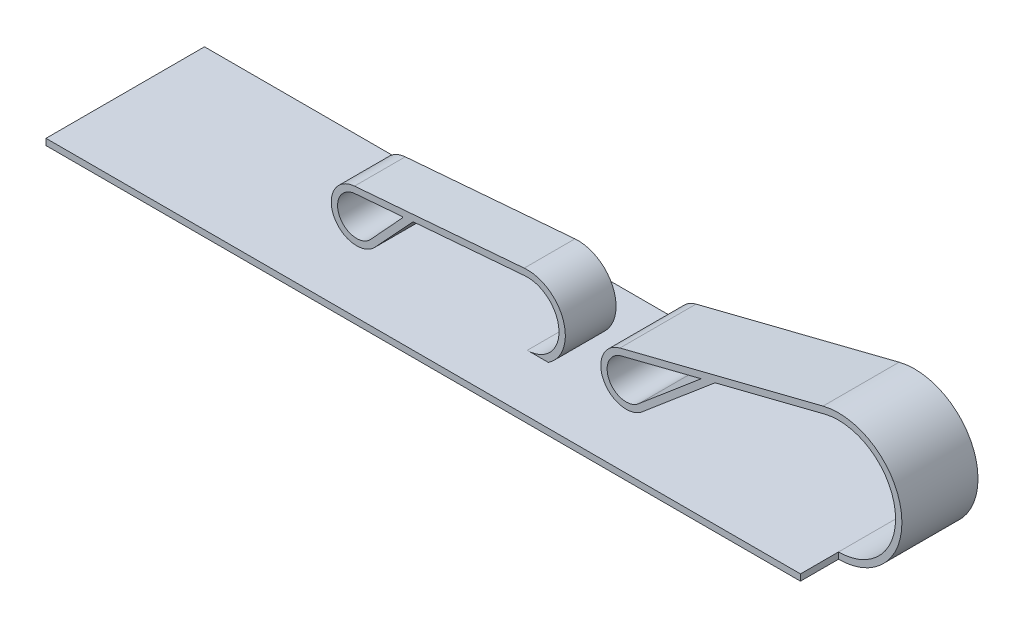
ISO-10303-21;
HEADER;
FILE_DESCRIPTION(('STEP AP214'),'2;1');
FILE_NAME('part.step','',(''),(''),'','','');
FILE_SCHEMA(('AUTOMOTIVE_DESIGN { 1 0 10303 214 1 1 1 1 }'));
ENDSEC;
DATA;
#1=APPLICATION_CONTEXT('core data for automotive mechanical design processes');
#2=APPLICATION_PROTOCOL_DEFINITION('international standard','automotive_design',2000,#1);
#3=PRODUCT_CONTEXT('',#1,'mechanical');
#4=PRODUCT('Part','Part','',(#3));
#5=PRODUCT_RELATED_PRODUCT_CATEGORY('part','',(#4));
#6=PRODUCT_DEFINITION_FORMATION('','',#4);
#7=PRODUCT_DEFINITION_CONTEXT('part definition',#1,'design');
#8=PRODUCT_DEFINITION('design','',#6,#7);
#9=PRODUCT_DEFINITION_SHAPE('','',#8);
#10=(LENGTH_UNIT() NAMED_UNIT(*) SI_UNIT(.MILLI.,.METRE.));
#11=(NAMED_UNIT(*) PLANE_ANGLE_UNIT() SI_UNIT($,.RADIAN.));
#12=(NAMED_UNIT(*) SI_UNIT($,.STERADIAN.) SOLID_ANGLE_UNIT());
#13=UNCERTAINTY_MEASURE_WITH_UNIT(LENGTH_MEASURE(1.E-05),#10,'distance_accuracy_value','');
#14=(GEOMETRIC_REPRESENTATION_CONTEXT(3) GLOBAL_UNCERTAINTY_ASSIGNED_CONTEXT((#13)) GLOBAL_UNIT_ASSIGNED_CONTEXT((#10,
#11,#12)) REPRESENTATION_CONTEXT('',''));
#15=CARTESIAN_POINT('',(0.,0.,0.));
#16=DIRECTION('',(0.,0.,1.));
#17=DIRECTION('',(1.,0.,0.));
#18=AXIS2_PLACEMENT_3D('',#15,#16,#17);
#19=CARTESIAN_POINT('',(127.329435135242,0.,25.));
#20=DIRECTION('',(1.,0.,0.));
#21=DIRECTION('',(0.,0.,-1.));
#22=AXIS2_PLACEMENT_3D('',#19,#20,#21);
#23=PLANE('',#22);
#24=DIRECTION('',(0.,0.,-1.));
#25=VECTOR('',#24,1.);
#26=CARTESIAN_POINT('',(127.329435135242,0.,25.));
#27=LINE('',#26,#25);
#28=CARTESIAN_POINT('',(127.329435135242,0.,7.));
#29=VERTEX_POINT('',#28);
#30=CARTESIAN_POINT('',(127.329435135242,0.,0.));
#31=VERTEX_POINT('',#30);
#32=EDGE_CURVE('E316',#29,#31,#27,.T.);
#33=ORIENTED_EDGE('',*,*,#32,.F.);
#34=DIRECTION('',(0.,-1.,0.));
#35=VECTOR('',#34,1.);
#36=CARTESIAN_POINT('',(127.329435135242,0.,7.));
#37=LINE('',#36,#35);
#38=CARTESIAN_POINT('',(127.329435135242,-1.,7.));
#39=VERTEX_POINT('',#38);
#40=EDGE_CURVE('E365',#29,#39,#37,.T.);
#41=ORIENTED_EDGE('',*,*,#40,.T.);
#42=DIRECTION('',(0.,0.,-1.));
#43=VECTOR('',#42,1.);
#44=CARTESIAN_POINT('',(127.329435135242,-1.,25.));
#45=LINE('',#44,#43);
#46=CARTESIAN_POINT('',(127.329435135242,-1.,0.));
#47=VERTEX_POINT('',#46);
#48=EDGE_CURVE('E312',#39,#47,#45,.T.);
#49=ORIENTED_EDGE('',*,*,#48,.T.);
#50=DIRECTION('',(0.,-1.,0.));
#51=VECTOR('',#50,1.);
#52=CARTESIAN_POINT('',(127.329435135242,0.,0.));
#53=LINE('',#52,#51);
#54=EDGE_CURVE('E296',#31,#47,#53,.T.);
#55=ORIENTED_EDGE('',*,*,#54,.F.);
#56=EDGE_LOOP('',(#33,#41,#49,#55));
#57=FACE_BOUND('',#56,.T.);
#58=ADVANCED_FACE('F39',(#57),#23,.T.);
#59=CARTESIAN_POINT('',(75.2426269984619,5.,16.));
#60=DIRECTION('',(0.,0.,-1.));
#61=DIRECTION('',(-1.,0.,0.));
#62=AXIS2_PLACEMENT_3D('',#59,#60,#61);
#63=CYLINDRICAL_SURFACE('',#62,6.);
#64=CARTESIAN_POINT('',(75.2426269984619,5.,8.));
#65=DIRECTION('',(0.,0.,1.));
#66=DIRECTION('',(1.,0.,0.));
#67=AXIS2_PLACEMENT_3D('',#64,#65,#66);
#68=CIRCLE('',#67,6.);
#69=CARTESIAN_POINT('',(78.5592517888173,0.,8.));
#70=VERTEX_POINT('',#69);
#71=CARTESIAN_POINT('',(74.7562436239485,10.9802534405322,8.));
#72=VERTEX_POINT('',#71);
#73=EDGE_CURVE('E214',#70,#72,#68,.T.);
#74=ORIENTED_EDGE('',*,*,#73,.T.);
#75=DIRECTION('',(0.,0.,-1.));
#76=VECTOR('',#75,1.);
#77=CARTESIAN_POINT('',(74.7562436239485,10.9802534405322,16.));
#78=LINE('',#77,#76);
#79=CARTESIAN_POINT('',(74.7562436239485,10.9802534405322,16.));
#80=VERTEX_POINT('',#79);
#81=EDGE_CURVE('E49',#80,#72,#78,.T.);
#82=ORIENTED_EDGE('',*,*,#81,.F.);
#83=CARTESIAN_POINT('',(75.2426269984619,5.,16.));
#84=DIRECTION('',(0.,0.,1.));
#85=DIRECTION('',(1.,0.,0.));
#86=AXIS2_PLACEMENT_3D('',#83,#84,#85);
#87=CIRCLE('',#86,6.);
#88=CARTESIAN_POINT('',(78.5592517888173,0.,16.));
#89=VERTEX_POINT('',#88);
#90=EDGE_CURVE('E283',#89,#80,#87,.T.);
#91=ORIENTED_EDGE('',*,*,#90,.F.);
#92=DIRECTION('',(0.,0.,-1.));
#93=VECTOR('',#92,1.);
#94=CARTESIAN_POINT('',(78.5592517888173,0.,16.));
#95=LINE('',#94,#93);
#96=EDGE_CURVE('E11',#89,#70,#95,.T.);
#97=ORIENTED_EDGE('',*,*,#96,.T.);
#98=EDGE_LOOP('',(#74,#82,#91,#97));
#99=FACE_BOUND('',#98,.T.);
#100=ADVANCED_FACE('F558',(#99),#63,.T.);
#101=CARTESIAN_POINT('',(-0.395922881299758,4.86801008658501,16.));
#102=DIRECTION('',(0.0810638957522267,-0.996708906755363,0.));
#103=DIRECTION('',(0.996708906755364,0.0810638957522267,0.));
#104=AXIS2_PLACEMENT_3D('',#101,#102,#103);
#105=PLANE('',#104);
#106=DIRECTION('',(-0.996708906755364,-0.0810638957522267,0.));
#107=VECTOR('',#106,1.);
#108=CARTESIAN_POINT('',(-0.395922881299758,4.86801008658501,8.));
#109=LINE('',#108,#107);
#110=CARTESIAN_POINT('',(47.9943397060956,8.8036658986488,8.));
#111=VERTEX_POINT('',#110);
#112=EDGE_CURVE('E217',#72,#111,#109,.T.);
#113=ORIENTED_EDGE('',*,*,#112,.T.);
#114=DIRECTION('',(0.,0.,-1.));
#115=VECTOR('',#114,1.);
#116=CARTESIAN_POINT('',(47.9943397060956,8.8036658986488,16.));
#117=LINE('',#116,#115);
#118=CARTESIAN_POINT('',(47.9943397060956,8.8036658986488,16.));
#119=VERTEX_POINT('',#118);
#120=EDGE_CURVE('E239',#119,#111,#117,.T.);
#121=ORIENTED_EDGE('',*,*,#120,.F.);
#122=DIRECTION('',(-0.996708906755364,-0.0810638957522267,0.));
#123=VECTOR('',#122,1.);
#124=CARTESIAN_POINT('',(-0.395922881299758,4.86801008658501,16.));
#125=LINE('',#124,#123);
#126=EDGE_CURVE('E289',#80,#119,#125,.T.);
#127=ORIENTED_EDGE('',*,*,#126,.F.);
#128=ORIENTED_EDGE('',*,*,#81,.T.);
#129=EDGE_LOOP('',(#113,#121,#127,#128));
#130=FACE_BOUND('',#129,.T.);
#131=ADVANCED_FACE('F563',(#130),#105,.F.);
#132=CARTESIAN_POINT('',(48.3185952891045,4.81683027162734,16.));
#133=DIRECTION('',(0.,0.,-1.));
#134=DIRECTION('',(-1.,0.,0.));
#135=AXIS2_PLACEMENT_3D('',#132,#133,#134);
#136=CYLINDRICAL_SURFACE('',#135,4.);
#137=CARTESIAN_POINT('',(48.3185952891045,4.81683027162734,8.));
#138=DIRECTION('',(0.,0.,1.));
#139=DIRECTION('',(1.,0.,0.));
#140=AXIS2_PLACEMENT_3D('',#137,#138,#139);
#141=CIRCLE('',#140,4.);
#142=CARTESIAN_POINT('',(51.2601187742751,2.1062141818444,8.));
#143=VERTEX_POINT('',#142);
#144=EDGE_CURVE('E220',#111,#143,#141,.T.);
#145=ORIENTED_EDGE('',*,*,#144,.T.);
#146=DIRECTION('',(0.,0.,-1.));
#147=VECTOR('',#146,1.);
#148=CARTESIAN_POINT('',(51.2601187742751,2.1062141818444,16.));
#149=LINE('',#148,#147);
#150=CARTESIAN_POINT('',(51.2601187742751,2.1062141818444,16.));
#151=VERTEX_POINT('',#150);
#152=EDGE_CURVE('E172',#151,#143,#149,.T.);
#153=ORIENTED_EDGE('',*,*,#152,.F.);
#154=CARTESIAN_POINT('',(48.3185952891045,4.81683027162734,16.));
#155=DIRECTION('',(0.,0.,1.));
#156=DIRECTION('',(1.,0.,0.));
#157=AXIS2_PLACEMENT_3D('',#154,#155,#156);
#158=CIRCLE('',#157,4.);
#159=EDGE_CURVE('E181',#119,#151,#158,.T.);
#160=ORIENTED_EDGE('',*,*,#159,.F.);
#161=ORIENTED_EDGE('',*,*,#120,.T.);
#162=EDGE_LOOP('',(#145,#153,#160,#161));
#163=FACE_BOUND('',#162,.T.);
#164=ADVANCED_FACE('F593',(#163),#136,.T.);
#165=CARTESIAN_POINT('',(26.5165631573194,-24.5832555566649,16.));
#166=DIRECTION('',(0.733334755814055,-0.679867734133001,0.));
#167=DIRECTION('',(0.679867734133001,0.733334755814055,0.));
#168=AXIS2_PLACEMENT_3D('',#165,#166,#167);
#169=PLANE('',#168);
#170=DIRECTION('',(-0.679867734133001,-0.733334755814055,0.));
#171=VECTOR('',#170,1.);
#172=CARTESIAN_POINT('',(26.5165631573194,-24.5832555566649,8.));
#173=LINE('',#172,#171);
#174=CARTESIAN_POINT('',(57.2359442407122,8.55199810304425,8.));
#175=VERTEX_POINT('',#174);
#176=EDGE_CURVE('E166',#175,#143,#173,.T.);
#177=ORIENTED_EDGE('',*,*,#176,.F.);
#178=DIRECTION('',(0.,0.,-1.));
#179=VECTOR('',#178,1.);
#180=CARTESIAN_POINT('',(57.2359442407122,8.55199810304425,16.));
#181=LINE('',#180,#179);
#182=CARTESIAN_POINT('',(57.2359442407122,8.55199810304425,16.));
#183=VERTEX_POINT('',#182);
#184=EDGE_CURVE('E161',#183,#175,#181,.T.);
#185=ORIENTED_EDGE('',*,*,#184,.F.);
#186=DIRECTION('',(-0.679867734133001,-0.733334755814055,0.));
#187=VECTOR('',#186,1.);
#188=CARTESIAN_POINT('',(26.5165631573194,-24.5832555566649,16.));
#189=LINE('',#188,#187);
#190=EDGE_CURVE('E164',#183,#151,#189,.T.);
#191=ORIENTED_EDGE('',*,*,#190,.T.);
#192=ORIENTED_EDGE('',*,*,#152,.T.);
#193=EDGE_LOOP('',(#177,#185,#191,#192));
#194=FACE_BOUND('',#193,.T.);
#195=ADVANCED_FACE('F163',(#194),#169,.T.);
#196=CARTESIAN_POINT('',(-0.314858985547531,3.87130117982963,16.));
#197=DIRECTION('',(0.0810638957522269,-0.996708906755363,0.));
#198=DIRECTION('',(0.996708906755364,0.0810638957522269,0.));
#199=AXIS2_PLACEMENT_3D('',#196,#197,#198);
#200=PLANE('',#199);
#201=DIRECTION('',(-0.996708906755364,-0.0810638957522269,0.));
#202=VECTOR('',#201,1.);
#203=CARTESIAN_POINT('',(-0.314858985547531,3.87130117982963,8.));
#204=LINE('',#203,#202);
#205=CARTESIAN_POINT('',(74.8373075197007,9.98354453377682,8.));
#206=VERTEX_POINT('',#205);
#207=EDGE_CURVE('E226',#206,#175,#204,.T.);
#208=ORIENTED_EDGE('',*,*,#207,.F.);
#209=DIRECTION('',(0.,0.,-1.));
#210=VECTOR('',#209,1.);
#211=CARTESIAN_POINT('',(74.8373075197007,9.98354453377682,16.));
#212=LINE('',#211,#210);
#213=CARTESIAN_POINT('',(74.8373075197007,9.98354453377682,16.));
#214=VERTEX_POINT('',#213);
#215=EDGE_CURVE('E173',#214,#206,#212,.T.);
#216=ORIENTED_EDGE('',*,*,#215,.F.);
#217=DIRECTION('',(-0.996708906755364,-0.0810638957522269,0.));
#218=VECTOR('',#217,1.);
#219=CARTESIAN_POINT('',(-0.314858985547531,3.87130117982963,16.));
#220=LINE('',#219,#218);
#221=EDGE_CURVE('E179',#214,#183,#220,.T.);
#222=ORIENTED_EDGE('',*,*,#221,.T.);
#223=ORIENTED_EDGE('',*,*,#184,.T.);
#224=EDGE_LOOP('',(#208,#216,#222,#223));
#225=FACE_BOUND('',#224,.T.);
#226=ADVANCED_FACE('F185',(#225),#200,.T.);
#227=CARTESIAN_POINT('',(55.4800353307855,8.30885708646239,16.));
#228=DIRECTION('',(0.,0.,-1.));
#229=DIRECTION('',(-1.,0.,0.));
#230=AXIS2_PLACEMENT_3D('',#227,#228,#229);
#231=CYLINDRICAL_SURFACE('',#230,0.0999999999999996);
#232=CARTESIAN_POINT('',(55.4800353307855,8.30885708646239,8.));
#233=DIRECTION('',(0.,0.,1.));
#234=DIRECTION('',(1.,0.,0.));
#235=AXIS2_PLACEMENT_3D('',#232,#233,#234);
#236=CIRCLE('',#235,0.0999999999999996);
#237=CARTESIAN_POINT('',(55.5535734179148,8.24109168421781,8.));
#238=VERTEX_POINT('',#237);
#239=CARTESIAN_POINT('',(55.4719289412103,8.40852797713792,8.));
#240=VERTEX_POINT('',#239);
#241=EDGE_CURVE('E195',#238,#240,#236,.T.);
#242=ORIENTED_EDGE('',*,*,#241,.F.);
#243=DIRECTION('',(0.,0.,-1.));
#244=VECTOR('',#243,1.);
#245=CARTESIAN_POINT('',(55.5535734179148,8.24109168421781,16.));
#246=LINE('',#245,#244);
#247=CARTESIAN_POINT('',(55.5535734179148,8.24109168421781,16.));
#248=VERTEX_POINT('',#247);
#249=EDGE_CURVE('E43',#248,#238,#246,.T.);
#250=ORIENTED_EDGE('',*,*,#249,.F.);
#251=CARTESIAN_POINT('',(55.4800353307855,8.30885708646239,16.));
#252=DIRECTION('',(0.,0.,1.));
#253=DIRECTION('',(1.,0.,0.));
#254=AXIS2_PLACEMENT_3D('',#251,#252,#253);
#255=CIRCLE('',#254,0.0999999999999996);
#256=CARTESIAN_POINT('',(55.4719289412103,8.40852797713792,16.));
#257=VERTEX_POINT('',#256);
#258=EDGE_CURVE('E232',#248,#257,#255,.T.);
#259=ORIENTED_EDGE('',*,*,#258,.T.);
#260=DIRECTION('',(0.,0.,-1.));
#261=VECTOR('',#260,1.);
#262=CARTESIAN_POINT('',(55.4719289412103,8.40852797713792,16.));
#263=LINE('',#262,#261);
#264=EDGE_CURVE('E191',#257,#240,#263,.T.);
#265=ORIENTED_EDGE('',*,*,#264,.T.);
#266=EDGE_LOOP('',(#242,#250,#259,#265));
#267=FACE_BOUND('',#266,.T.);
#268=ADVANCED_FACE('F41',(#267),#231,.F.);
#269=CARTESIAN_POINT('',(25.9357260574453,-23.8997909436845,16.));
#270=DIRECTION('',(-0.735380871292634,0.677654022445736,0.));
#271=DIRECTION('',(-0.677654022445736,-0.735380871292634,0.));
#272=AXIS2_PLACEMENT_3D('',#269,#270,#271);
#273=PLANE('',#272);
#274=DIRECTION('',(0.677654022445736,0.735380871292634,0.));
#275=VECTOR('',#274,1.);
#276=CARTESIAN_POINT('',(25.9357260574453,-23.8997909436845,8.));
#277=LINE('',#276,#275);
#278=CARTESIAN_POINT('',(50.5247379029824,2.78386820429014,8.));
#279=VERTEX_POINT('',#278);
#280=EDGE_CURVE('E199',#279,#238,#277,.T.);
#281=ORIENTED_EDGE('',*,*,#280,.F.);
#282=DIRECTION('',(0.,0.,-1.));
#283=VECTOR('',#282,1.);
#284=CARTESIAN_POINT('',(50.5247379029824,2.78386820429014,16.));
#285=LINE('',#284,#283);
#286=CARTESIAN_POINT('',(50.5247379029824,2.78386820429014,16.));
#287=VERTEX_POINT('',#286);
#288=EDGE_CURVE('E250',#287,#279,#285,.T.);
#289=ORIENTED_EDGE('',*,*,#288,.F.);
#290=DIRECTION('',(0.677654022445736,0.735380871292634,0.));
#291=VECTOR('',#290,1.);
#292=CARTESIAN_POINT('',(25.9357260574453,-23.8997909436845,16.));
#293=LINE('',#292,#291);
#294=EDGE_CURVE('E262',#287,#248,#293,.T.);
#295=ORIENTED_EDGE('',*,*,#294,.T.);
#296=ORIENTED_EDGE('',*,*,#249,.T.);
#297=EDGE_LOOP('',(#281,#289,#295,#296));
#298=FACE_BOUND('',#297,.T.);
#299=ADVANCED_FACE('F260',(#298),#273,.T.);
#300=CARTESIAN_POINT('',(48.3185952891045,4.81683027162734,16.));
#301=DIRECTION('',(0.,0.,-1.));
#302=DIRECTION('',(-1.,0.,0.));
#303=AXIS2_PLACEMENT_3D('',#300,#301,#302);
#304=CYLINDRICAL_SURFACE('',#303,3.);
#305=CARTESIAN_POINT('',(48.3185952891045,4.81683027162734,8.));
#306=DIRECTION('',(0.,0.,1.));
#307=DIRECTION('',(1.,0.,0.));
#308=AXIS2_PLACEMENT_3D('',#305,#306,#307);
#309=CIRCLE('',#308,3.);
#310=CARTESIAN_POINT('',(48.0754036018478,7.80695699189343,8.));
#311=VERTEX_POINT('',#310);
#312=EDGE_CURVE('E204',#311,#279,#309,.T.);
#313=ORIENTED_EDGE('',*,*,#312,.F.);
#314=DIRECTION('',(0.,0.,-1.));
#315=VECTOR('',#314,1.);
#316=CARTESIAN_POINT('',(48.0754036018478,7.80695699189343,16.));
#317=LINE('',#316,#315);
#318=CARTESIAN_POINT('',(48.0754036018478,7.80695699189343,16.));
#319=VERTEX_POINT('',#318);
#320=EDGE_CURVE('E248',#319,#311,#317,.T.);
#321=ORIENTED_EDGE('',*,*,#320,.F.);
#322=CARTESIAN_POINT('',(48.3185952891045,4.81683027162734,16.));
#323=DIRECTION('',(0.,0.,1.));
#324=DIRECTION('',(1.,0.,0.));
#325=AXIS2_PLACEMENT_3D('',#322,#323,#324);
#326=CIRCLE('',#325,3.);
#327=EDGE_CURVE('E268',#319,#287,#326,.T.);
#328=ORIENTED_EDGE('',*,*,#327,.T.);
#329=ORIENTED_EDGE('',*,*,#288,.T.);
#330=EDGE_LOOP('',(#313,#321,#328,#329));
#331=FACE_BOUND('',#330,.T.);
#332=ADVANCED_FACE('F266',(#331),#304,.F.);
#333=CARTESIAN_POINT('',(-0.314858985547531,3.87130117982963,16.));
#334=DIRECTION('',(0.0810638957522269,-0.996708906755363,0.));
#335=DIRECTION('',(0.996708906755364,0.0810638957522269,0.));
#336=AXIS2_PLACEMENT_3D('',#333,#334,#335);
#337=PLANE('',#336);
#338=DIRECTION('',(-0.996708906755364,-0.0810638957522269,0.));
#339=VECTOR('',#338,1.);
#340=CARTESIAN_POINT('',(-0.314858985547531,3.87130117982963,8.));
#341=LINE('',#340,#339);
#342=EDGE_CURVE('E208',#240,#311,#341,.T.);
#343=ORIENTED_EDGE('',*,*,#342,.F.);
#344=ORIENTED_EDGE('',*,*,#264,.F.);
#345=DIRECTION('',(-0.996708906755364,-0.0810638957522269,0.));
#346=VECTOR('',#345,1.);
#347=CARTESIAN_POINT('',(-0.314858985547531,3.87130117982963,16.));
#348=LINE('',#347,#346);
#349=EDGE_CURVE('E273',#257,#319,#348,.T.);
#350=ORIENTED_EDGE('',*,*,#349,.T.);
#351=ORIENTED_EDGE('',*,*,#320,.T.);
#352=EDGE_LOOP('',(#343,#344,#350,#351));
#353=FACE_BOUND('',#352,.T.);
#354=ADVANCED_FACE('F276',(#353),#337,.T.);
#355=CARTESIAN_POINT('',(75.2426269984619,5.,16.));
#356=DIRECTION('',(0.,0.,-1.));
#357=DIRECTION('',(-1.,0.,0.));
#358=AXIS2_PLACEMENT_3D('',#355,#356,#357);
#359=CYLINDRICAL_SURFACE('',#358,5.);
#360=CARTESIAN_POINT('',(75.2426269984619,5.,8.));
#361=DIRECTION('',(0.,0.,1.));
#362=DIRECTION('',(1.,0.,0.));
#363=AXIS2_PLACEMENT_3D('',#360,#361,#362);
#364=CIRCLE('',#363,5.);
#365=CARTESIAN_POINT('',(75.2426269984619,0.,8.));
#366=VERTEX_POINT('',#365);
#367=EDGE_CURVE('E229',#366,#206,#364,.T.);
#368=ORIENTED_EDGE('',*,*,#367,.F.);
#369=DIRECTION('',(0.,0.,-1.));
#370=VECTOR('',#369,1.);
#371=CARTESIAN_POINT('',(75.2426269984619,0.,16.));
#372=LINE('',#371,#370);
#373=CARTESIAN_POINT('',(75.2426269984619,0.,16.));
#374=VERTEX_POINT('',#373);
#375=EDGE_CURVE('E69',#374,#366,#372,.T.);
#376=ORIENTED_EDGE('',*,*,#375,.F.);
#377=CARTESIAN_POINT('',(75.2426269984619,5.,16.));
#378=DIRECTION('',(0.,0.,1.));
#379=DIRECTION('',(1.,0.,0.));
#380=AXIS2_PLACEMENT_3D('',#377,#378,#379);
#381=CIRCLE('',#380,5.);
#382=EDGE_CURVE('E187',#374,#214,#381,.T.);
#383=ORIENTED_EDGE('',*,*,#382,.T.);
#384=ORIENTED_EDGE('',*,*,#215,.T.);
#385=EDGE_LOOP('',(#368,#376,#383,#384));
#386=FACE_BOUND('',#385,.T.);
#387=ADVANCED_FACE('F584',(#386),#359,.F.);
#388=CARTESIAN_POINT('',(0.,0.,16.));
#389=DIRECTION('',(0.,0.,1.));
#390=DIRECTION('',(1.,0.,0.));
#391=AXIS2_PLACEMENT_3D('',#388,#389,#390);
#392=PLANE('',#391);
#393=ORIENTED_EDGE('',*,*,#258,.F.);
#394=ORIENTED_EDGE('',*,*,#294,.F.);
#395=ORIENTED_EDGE('',*,*,#327,.F.);
#396=ORIENTED_EDGE('',*,*,#349,.F.);
#397=EDGE_LOOP('',(#393,#394,#395,#396));
#398=FACE_BOUND('',#397,.T.);
#399=DIRECTION('',(1.,0.,0.));
#400=VECTOR('',#399,1.);
#401=CARTESIAN_POINT('',(0.,0.,16.));
#402=LINE('',#401,#400);
#403=EDGE_CURVE('E278',#374,#89,#402,.T.);
#404=ORIENTED_EDGE('',*,*,#403,.T.);
#405=ORIENTED_EDGE('',*,*,#90,.T.);
#406=ORIENTED_EDGE('',*,*,#126,.T.);
#407=ORIENTED_EDGE('',*,*,#159,.T.);
#408=ORIENTED_EDGE('',*,*,#190,.F.);
#409=ORIENTED_EDGE('',*,*,#221,.F.);
#410=ORIENTED_EDGE('',*,*,#382,.F.);
#411=EDGE_LOOP('',(#404,#405,#406,#407,#408,#409,#410));
#412=FACE_BOUND('',#411,.T.);
#413=ADVANCED_FACE('F178',(#398,#412),#392,.T.);
#414=CARTESIAN_POINT('',(0.,0.,8.));
#415=DIRECTION('',(0.,0.,1.));
#416=DIRECTION('',(1.,0.,0.));
#417=AXIS2_PLACEMENT_3D('',#414,#415,#416);
#418=PLANE('',#417);
#419=ORIENTED_EDGE('',*,*,#241,.T.);
#420=ORIENTED_EDGE('',*,*,#342,.T.);
#421=ORIENTED_EDGE('',*,*,#312,.T.);
#422=ORIENTED_EDGE('',*,*,#280,.T.);
#423=EDGE_LOOP('',(#419,#420,#421,#422));
#424=FACE_BOUND('',#423,.T.);
#425=DIRECTION('',(1.,0.,0.));
#426=VECTOR('',#425,1.);
#427=CARTESIAN_POINT('',(0.,0.,8.));
#428=LINE('',#427,#426);
#429=EDGE_CURVE('E119',#366,#70,#428,.T.);
#430=ORIENTED_EDGE('',*,*,#429,.F.);
#431=ORIENTED_EDGE('',*,*,#367,.T.);
#432=ORIENTED_EDGE('',*,*,#207,.T.);
#433=ORIENTED_EDGE('',*,*,#176,.T.);
#434=ORIENTED_EDGE('',*,*,#144,.F.);
#435=ORIENTED_EDGE('',*,*,#112,.F.);
#436=ORIENTED_EDGE('',*,*,#73,.F.);
#437=EDGE_LOOP('',(#430,#431,#432,#433,#434,#435,#436));
#438=FACE_BOUND('',#437,.T.);
#439=ADVANCED_FACE('F265',(#424,#438),#418,.F.);
#440=CARTESIAN_POINT('',(0.,0.,25.));
#441=DIRECTION('',(0.,1.,0.));
#442=DIRECTION('',(-1.,0.,0.));
#443=AXIS2_PLACEMENT_3D('',#440,#441,#442);
#444=PLANE('',#443);
#445=ORIENTED_EDGE('',*,*,#96,.F.);
#446=ORIENTED_EDGE('',*,*,#403,.F.);
#447=ORIENTED_EDGE('',*,*,#375,.T.);
#448=ORIENTED_EDGE('',*,*,#429,.T.);
#449=EDGE_LOOP('',(#445,#446,#447,#448));
#450=FACE_BOUND('',#449,.T.);
#451=DIRECTION('',(1.,0.,0.));
#452=VECTOR('',#451,1.);
#453=CARTESIAN_POINT('',(0.,0.,0.));
#454=LINE('',#453,#452);
#455=CARTESIAN_POINT('',(8.32943513524181,0.,0.));
#456=VERTEX_POINT('',#455);
#457=EDGE_CURVE('E326',#456,#31,#454,.T.);
#458=ORIENTED_EDGE('',*,*,#457,.F.);
#459=DIRECTION('',(0.,0.,-1.));
#460=VECTOR('',#459,1.);
#461=CARTESIAN_POINT('',(8.32943513524181,0.,25.));
#462=LINE('',#461,#460);
#463=CARTESIAN_POINT('',(8.32943513524181,0.,25.));
#464=VERTEX_POINT('',#463);
#465=EDGE_CURVE('E200',#464,#456,#462,.T.);
#466=ORIENTED_EDGE('',*,*,#465,.F.);
#467=DIRECTION('',(1.,0.,0.));
#468=VECTOR('',#467,1.);
#469=CARTESIAN_POINT('',(0.,0.,25.));
#470=LINE('',#469,#468);
#471=CARTESIAN_POINT('',(127.329435135242,0.,25.));
#472=VERTEX_POINT('',#471);
#473=EDGE_CURVE('E292',#464,#472,#470,.T.);
#474=ORIENTED_EDGE('',*,*,#473,.T.);
#475=CARTESIAN_POINT('',(127.329435135242,0.,19.));
#476=VERTEX_POINT('',#475);
#477=EDGE_CURVE('E313',#472,#476,#27,.T.);
#478=ORIENTED_EDGE('',*,*,#477,.T.);
#479=DIRECTION('',(0.,0.,-1.));
#480=VECTOR('',#479,1.);
#481=CARTESIAN_POINT('',(127.329435135242,0.,19.));
#482=LINE('',#481,#480);
#483=EDGE_CURVE('E356',#476,#29,#482,.T.);
#484=ORIENTED_EDGE('',*,*,#483,.T.);
#485=ORIENTED_EDGE('',*,*,#32,.T.);
#486=EDGE_LOOP('',(#458,#466,#474,#478,#484,#485));
#487=FACE_BOUND('',#486,.T.);
#488=ADVANCED_FACE('F501',(#450,#487),#444,.T.);
#489=CARTESIAN_POINT('',(8.32943513524181,0.,25.));
#490=DIRECTION('',(1.,0.,0.));
#491=DIRECTION('',(0.,0.,-1.));
#492=AXIS2_PLACEMENT_3D('',#489,#490,#491);
#493=PLANE('',#492);
#494=DIRECTION('',(0.,-1.,0.));
#495=VECTOR('',#494,1.);
#496=CARTESIAN_POINT('',(8.32943513524181,0.,0.));
#497=LINE('',#496,#495);
#498=CARTESIAN_POINT('',(8.32943513524181,-0.999999999999999,0.));
#499=VERTEX_POINT('',#498);
#500=EDGE_CURVE('E323',#456,#499,#497,.T.);
#501=ORIENTED_EDGE('',*,*,#500,.T.);
#502=DIRECTION('',(0.,0.,-1.));
#503=VECTOR('',#502,1.);
#504=CARTESIAN_POINT('',(8.32943513524181,-0.999999999999999,25.));
#505=LINE('',#504,#503);
#506=CARTESIAN_POINT('',(8.32943513524181,-0.999999999999999,25.));
#507=VERTEX_POINT('',#506);
#508=EDGE_CURVE('E306',#507,#499,#505,.T.);
#509=ORIENTED_EDGE('',*,*,#508,.F.);
#510=DIRECTION('',(0.,-1.,0.));
#511=VECTOR('',#510,1.);
#512=CARTESIAN_POINT('',(8.32943513524181,0.,25.));
#513=LINE('',#512,#511);
#514=EDGE_CURVE('E295',#464,#507,#513,.T.);
#515=ORIENTED_EDGE('',*,*,#514,.F.);
#516=ORIENTED_EDGE('',*,*,#465,.T.);
#517=EDGE_LOOP('',(#501,#509,#515,#516));
#518=FACE_BOUND('',#517,.T.);
#519=ADVANCED_FACE('F517',(#518),#493,.F.);
#520=CARTESIAN_POINT('',(0.,-0.999999999999998,25.));
#521=DIRECTION('',(0.,1.,0.));
#522=DIRECTION('',(-1.,0.,0.));
#523=AXIS2_PLACEMENT_3D('',#520,#521,#522);
#524=PLANE('',#523);
#525=DIRECTION('',(1.,0.,0.));
#526=VECTOR('',#525,1.);
#527=CARTESIAN_POINT('',(0.,-0.999999999999998,0.));
#528=LINE('',#527,#526);
#529=EDGE_CURVE('E319',#499,#47,#528,.T.);
#530=ORIENTED_EDGE('',*,*,#529,.T.);
#531=ORIENTED_EDGE('',*,*,#48,.F.);
#532=DIRECTION('',(0.,0.,-1.));
#533=VECTOR('',#532,1.);
#534=CARTESIAN_POINT('',(127.329435135242,-1.,19.));
#535=LINE('',#534,#533);
#536=CARTESIAN_POINT('',(127.329435135242,-1.,19.));
#537=VERTEX_POINT('',#536);
#538=EDGE_CURVE('E359',#537,#39,#535,.T.);
#539=ORIENTED_EDGE('',*,*,#538,.F.);
#540=CARTESIAN_POINT('',(127.329435135242,-1.,25.));
#541=VERTEX_POINT('',#540);
#542=EDGE_CURVE('E309',#541,#537,#45,.T.);
#543=ORIENTED_EDGE('',*,*,#542,.F.);
#544=DIRECTION('',(1.,0.,0.));
#545=VECTOR('',#544,1.);
#546=CARTESIAN_POINT('',(0.,-0.999999999999998,25.));
#547=LINE('',#546,#545);
#548=EDGE_CURVE('E298',#507,#541,#547,.T.);
#549=ORIENTED_EDGE('',*,*,#548,.F.);
#550=ORIENTED_EDGE('',*,*,#508,.T.);
#551=EDGE_LOOP('',(#530,#531,#539,#543,#549,#550));
#552=FACE_BOUND('',#551,.T.);
#553=ADVANCED_FACE('F511',(#552),#524,.F.);
#554=DIRECTION('',(0.,-1.,0.));
#555=VECTOR('',#554,1.);
#556=CARTESIAN_POINT('',(127.329435135242,0.,19.));
#557=LINE('',#556,#555);
#558=EDGE_CURVE('E394',#476,#537,#557,.T.);
#559=ORIENTED_EDGE('',*,*,#558,.F.);
#560=ORIENTED_EDGE('',*,*,#477,.F.);
#561=DIRECTION('',(0.,-1.,0.));
#562=VECTOR('',#561,1.);
#563=CARTESIAN_POINT('',(127.329435135242,0.,25.));
#564=LINE('',#563,#562);
#565=EDGE_CURVE('E300',#472,#541,#564,.T.);
#566=ORIENTED_EDGE('',*,*,#565,.T.);
#567=ORIENTED_EDGE('',*,*,#542,.T.);
#568=EDGE_LOOP('',(#559,#560,#566,#567));
#569=FACE_BOUND('',#568,.T.);
#570=ADVANCED_FACE('F524',(#569),#23,.T.);
#571=CARTESIAN_POINT('',(0.,0.,25.));
#572=DIRECTION('',(0.,0.,1.));
#573=DIRECTION('',(1.,0.,0.));
#574=AXIS2_PLACEMENT_3D('',#571,#572,#573);
#575=PLANE('',#574);
#576=ORIENTED_EDGE('',*,*,#473,.F.);
#577=ORIENTED_EDGE('',*,*,#514,.T.);
#578=ORIENTED_EDGE('',*,*,#548,.T.);
#579=ORIENTED_EDGE('',*,*,#565,.F.);
#580=EDGE_LOOP('',(#576,#577,#578,#579));
#581=FACE_BOUND('',#580,.T.);
#582=ADVANCED_FACE('F521',(#581),#575,.T.);
#583=CARTESIAN_POINT('',(0.,0.,0.));
#584=DIRECTION('',(0.,0.,1.));
#585=DIRECTION('',(1.,0.,0.));
#586=AXIS2_PLACEMENT_3D('',#583,#584,#585);
#587=PLANE('',#586);
#588=ORIENTED_EDGE('',*,*,#457,.T.);
#589=ORIENTED_EDGE('',*,*,#54,.T.);
#590=ORIENTED_EDGE('',*,*,#529,.F.);
#591=ORIENTED_EDGE('',*,*,#500,.F.);
#592=EDGE_LOOP('',(#588,#589,#590,#591));
#593=FACE_BOUND('',#592,.T.);
#594=ADVANCED_FACE('F506',(#593),#587,.F.);
#595=CARTESIAN_POINT('',(3.0354699297206,-12.0353589773014,19.));
#596=DIRECTION('',(0.244554371309685,-0.969635580758733,0.));
#597=DIRECTION('',(0.969635580758733,0.244554371309685,0.));
#598=AXIS2_PLACEMENT_3D('',#595,#596,#597);
#599=PLANE('',#598);
#600=DIRECTION('',(-0.969635580758733,-0.244554371309685,0.));
#601=VECTOR('',#600,1.);
#602=CARTESIAN_POINT('',(3.0354699297206,-12.0353589773014,7.));
#603=LINE('',#602,#601);
#604=CARTESIAN_POINT('',(124.883891422145,18.6963558075873,7.));
#605=VERTEX_POINT('',#604);
#606=CARTESIAN_POINT('',(92.8559088743135,10.6184930602513,7.));
#607=VERTEX_POINT('',#606);
#608=EDGE_CURVE('E380',#605,#607,#603,.T.);
#609=ORIENTED_EDGE('',*,*,#608,.T.);
#610=DIRECTION('',(0.,0.,-1.));
#611=VECTOR('',#610,1.);
#612=CARTESIAN_POINT('',(92.8559088743135,10.6184930602513,19.));
#613=LINE('',#612,#611);
#614=CARTESIAN_POINT('',(92.8559088743135,10.6184930602513,19.));
#615=VERTEX_POINT('',#614);
#616=EDGE_CURVE('E329',#615,#607,#613,.T.);
#617=ORIENTED_EDGE('',*,*,#616,.F.);
#618=DIRECTION('',(-0.969635580758733,-0.244554371309685,0.));
#619=VECTOR('',#618,1.);
#620=CARTESIAN_POINT('',(3.0354699297206,-12.0353589773014,19.));
#621=LINE('',#620,#619);
#622=CARTESIAN_POINT('',(124.883891422145,18.6963558075873,19.));
#623=VERTEX_POINT('',#622);
#624=EDGE_CURVE('E409',#623,#615,#621,.T.);
#625=ORIENTED_EDGE('',*,*,#624,.F.);
#626=DIRECTION('',(0.,0.,-1.));
#627=VECTOR('',#626,1.);
#628=CARTESIAN_POINT('',(124.883891422145,18.6963558075873,19.));
#629=LINE('',#628,#627);
#630=EDGE_CURVE('E337',#623,#605,#629,.T.);
#631=ORIENTED_EDGE('',*,*,#630,.T.);
#632=EDGE_LOOP('',(#609,#617,#625,#631));
#633=FACE_BOUND('',#632,.T.);
#634=ADVANCED_FACE('F534',(#633),#599,.F.);
#635=CARTESIAN_POINT('',(93.8341263595522,6.73995073721642,19.));
#636=DIRECTION('',(0.,0.,-1.));
#637=DIRECTION('',(-1.,0.,0.));
#638=AXIS2_PLACEMENT_3D('',#635,#636,#637);
#639=CYLINDRICAL_SURFACE('',#638,4.);
#640=CARTESIAN_POINT('',(93.8341263595522,6.73995073721642,7.));
#641=DIRECTION('',(0.,0.,1.));
#642=DIRECTION('',(1.,0.,0.));
#643=AXIS2_PLACEMENT_3D('',#640,#641,#642);
#644=CIRCLE('',#643,4.);
#645=CARTESIAN_POINT('',(96.6378257125997,3.88701015989608,7.));
#646=VERTEX_POINT('',#645);
#647=EDGE_CURVE('E377',#607,#646,#644,.T.);
#648=ORIENTED_EDGE('',*,*,#647,.T.);
#649=DIRECTION('',(0.,0.,-1.));
#650=VECTOR('',#649,1.);
#651=CARTESIAN_POINT('',(96.6378257125997,3.88701015989608,19.));
#652=LINE('',#651,#650);
#653=CARTESIAN_POINT('',(96.6378257125997,3.88701015989608,19.));
#654=VERTEX_POINT('',#653);
#655=EDGE_CURVE('E347',#654,#646,#652,.T.);
#656=ORIENTED_EDGE('',*,*,#655,.F.);
#657=CARTESIAN_POINT('',(93.8341263595522,6.73995073721642,19.));
#658=DIRECTION('',(0.,0.,1.));
#659=DIRECTION('',(1.,0.,0.));
#660=AXIS2_PLACEMENT_3D('',#657,#658,#659);
#661=CIRCLE('',#660,4.);
#662=EDGE_CURVE('E406',#615,#654,#661,.T.);
#663=ORIENTED_EDGE('',*,*,#662,.F.);
#664=ORIENTED_EDGE('',*,*,#616,.T.);
#665=EDGE_LOOP('',(#648,#656,#663,#664));
#666=FACE_BOUND('',#665,.T.);
#667=ADVANCED_FACE('F538',(#666),#639,.T.);
#668=CARTESIAN_POINT('',(38.3618327128901,-45.378277500891,19.));
#669=DIRECTION('',(0.645597238535003,-0.763678077200059,0.));
#670=DIRECTION('',(0.763678077200059,0.645597238535003,0.));
#671=AXIS2_PLACEMENT_3D('',#668,#669,#670);
#672=PLANE('',#671);
#673=DIRECTION('',(-0.763678077200059,-0.645597238535003,0.));
#674=VECTOR('',#673,1.);
#675=CARTESIAN_POINT('',(38.3618327128901,-45.378277500891,7.));
#676=LINE('',#675,#674);
#677=CARTESIAN_POINT('',(107.8556191201,13.3702946256373,7.));
#678=VERTEX_POINT('',#677);
#679=EDGE_CURVE('E374',#678,#646,#676,.T.);
#680=ORIENTED_EDGE('',*,*,#679,.F.);
#681=DIRECTION('',(0.,0.,-1.));
#682=VECTOR('',#681,1.);
#683=CARTESIAN_POINT('',(107.8556191201,13.3702946256373,19.));
#684=LINE('',#683,#682);
#685=CARTESIAN_POINT('',(107.8556191201,13.3702946256373,19.));
#686=VERTEX_POINT('',#685);
#687=EDGE_CURVE('E350',#686,#678,#684,.T.);
#688=ORIENTED_EDGE('',*,*,#687,.F.);
#689=DIRECTION('',(-0.763678077200059,-0.645597238535003,0.));
#690=VECTOR('',#689,1.);
#691=CARTESIAN_POINT('',(38.3618327128901,-45.378277500891,19.));
#692=LINE('',#691,#690);
#693=EDGE_CURVE('E403',#686,#654,#692,.T.);
#694=ORIENTED_EDGE('',*,*,#693,.T.);
#695=ORIENTED_EDGE('',*,*,#655,.T.);
#696=EDGE_LOOP('',(#680,#688,#694,#695));
#697=FACE_BOUND('',#696,.T.);
#698=ADVANCED_FACE('F541',(#697),#672,.T.);
#699=CARTESIAN_POINT('',(3.28002430103028,-13.0049945580601,19.));
#700=DIRECTION('',(0.244554371309685,-0.969635580758733,0.));
#701=DIRECTION('',(0.969635580758733,0.244554371309685,0.));
#702=AXIS2_PLACEMENT_3D('',#699,#700,#701);
#703=PLANE('',#702);
#704=DIRECTION('',(-0.969635580758733,-0.244554371309685,0.));
#705=VECTOR('',#704,1.);
#706=CARTESIAN_POINT('',(3.28002430103028,-13.0049945580601,7.));
#707=LINE('',#706,#705);
#708=CARTESIAN_POINT('',(125.128445793455,17.7267202268286,7.));
#709=VERTEX_POINT('',#708);
#710=EDGE_CURVE('E371',#709,#678,#707,.T.);
#711=ORIENTED_EDGE('',*,*,#710,.F.);
#712=DIRECTION('',(0.,0.,-1.));
#713=VECTOR('',#712,1.);
#714=CARTESIAN_POINT('',(125.128445793455,17.7267202268286,19.));
#715=LINE('',#714,#713);
#716=CARTESIAN_POINT('',(125.128445793455,17.7267202268286,19.));
#717=VERTEX_POINT('',#716);
#718=EDGE_CURVE('E353',#717,#709,#715,.T.);
#719=ORIENTED_EDGE('',*,*,#718,.F.);
#720=DIRECTION('',(-0.969635580758733,-0.244554371309685,0.));
#721=VECTOR('',#720,1.);
#722=CARTESIAN_POINT('',(3.28002430103028,-13.0049945580601,19.));
#723=LINE('',#722,#721);
#724=EDGE_CURVE('E400',#717,#686,#723,.T.);
#725=ORIENTED_EDGE('',*,*,#724,.T.);
#726=ORIENTED_EDGE('',*,*,#687,.T.);
#727=EDGE_LOOP('',(#711,#719,#725,#726));
#728=FACE_BOUND('',#727,.T.);
#729=ADVANCED_FACE('F544',(#728),#703,.T.);
#730=CARTESIAN_POINT('',(127.329435135242,9.00000000000001,19.));
#731=DIRECTION('',(0.,0.,-1.));
#732=DIRECTION('',(-1.,0.,0.));
#733=AXIS2_PLACEMENT_3D('',#730,#731,#732);
#734=CYLINDRICAL_SURFACE('',#733,9.00000000000001);
#735=CARTESIAN_POINT('',(127.329435135242,9.00000000000001,7.));
#736=DIRECTION('',(0.,0.,1.));
#737=DIRECTION('',(1.,0.,0.));
#738=AXIS2_PLACEMENT_3D('',#735,#736,#737);
#739=CIRCLE('',#738,9.00000000000001);
#740=EDGE_CURVE('E368',#29,#709,#739,.T.);
#741=ORIENTED_EDGE('',*,*,#740,.F.);
#742=ORIENTED_EDGE('',*,*,#483,.F.);
#743=CARTESIAN_POINT('',(127.329435135242,9.00000000000001,19.));
#744=DIRECTION('',(0.,0.,1.));
#745=DIRECTION('',(1.,0.,0.));
#746=AXIS2_PLACEMENT_3D('',#743,#744,#745);
#747=CIRCLE('',#746,9.00000000000001);
#748=EDGE_CURVE('E397',#476,#717,#747,.T.);
#749=ORIENTED_EDGE('',*,*,#748,.T.);
#750=ORIENTED_EDGE('',*,*,#718,.T.);
#751=EDGE_LOOP('',(#741,#742,#749,#750));
#752=FACE_BOUND('',#751,.T.);
#753=ADVANCED_FACE('F547',(#752),#734,.F.);
#754=CARTESIAN_POINT('',(93.8341263595522,6.73995073721642,19.));
#755=DIRECTION('',(0.,0.,-1.));
#756=DIRECTION('',(-1.,0.,0.));
#757=AXIS2_PLACEMENT_3D('',#754,#755,#756);
#758=CYLINDRICAL_SURFACE('',#757,3.);
#759=CARTESIAN_POINT('',(93.8341263595522,6.73995073721642,7.));
#760=DIRECTION('',(0.,0.,1.));
#761=DIRECTION('',(1.,0.,0.));
#762=AXIS2_PLACEMENT_3D('',#759,#760,#761);
#763=CIRCLE('',#762,3.);
#764=CARTESIAN_POINT('',(93.1004632456232,9.64885747949261,7.));
#765=VERTEX_POINT('',#764);
#766=CARTESIAN_POINT('',(95.9369008743379,4.60024530422617,7.));
#767=VERTEX_POINT('',#766);
#768=EDGE_CURVE('E389',#765,#767,#763,.T.);
#769=ORIENTED_EDGE('',*,*,#768,.F.);
#770=DIRECTION('',(0.,0.,-1.));
#771=VECTOR('',#770,1.);
#772=CARTESIAN_POINT('',(93.1004632456232,9.64885747949261,19.));
#773=LINE('',#772,#771);
#774=CARTESIAN_POINT('',(93.1004632456232,9.64885747949261,19.));
#775=VERTEX_POINT('',#774);
#776=EDGE_CURVE('E334',#775,#765,#773,.T.);
#777=ORIENTED_EDGE('',*,*,#776,.F.);
#778=CARTESIAN_POINT('',(93.8341263595522,6.73995073721642,19.));
#779=DIRECTION('',(0.,0.,1.));
#780=DIRECTION('',(1.,0.,0.));
#781=AXIS2_PLACEMENT_3D('',#778,#779,#780);
#782=CIRCLE('',#781,3.);
#783=CARTESIAN_POINT('',(95.9369008743379,4.60024530422617,19.));
#784=VERTEX_POINT('',#783);
#785=EDGE_CURVE('E364',#775,#784,#782,.T.);
#786=ORIENTED_EDGE('',*,*,#785,.T.);
#787=DIRECTION('',(0.,0.,-1.));
#788=VECTOR('',#787,1.);
#789=CARTESIAN_POINT('',(95.9369008743379,4.60024530422617,19.));
#790=LINE('',#789,#788);
#791=EDGE_CURVE('E341',#784,#767,#790,.T.);
#792=ORIENTED_EDGE('',*,*,#791,.T.);
#793=EDGE_LOOP('',(#769,#777,#786,#792));
#794=FACE_BOUND('',#793,.T.);
#795=ADVANCED_FACE('F425',(#794),#758,.F.);
#796=CARTESIAN_POINT('',(3.28002430103029,-13.0049945580601,19.));
#797=DIRECTION('',(0.244554371309685,-0.969635580758733,0.));
#798=DIRECTION('',(0.969635580758733,0.244554371309685,0.));
#799=AXIS2_PLACEMENT_3D('',#796,#797,#798);
#800=PLANE('',#799);
#801=DIRECTION('',(-0.969635580758733,-0.244554371309685,0.));
#802=VECTOR('',#801,1.);
#803=CARTESIAN_POINT('',(3.28002430103029,-13.0049945580601,7.));
#804=LINE('',#803,#802);
#805=CARTESIAN_POINT('',(105.648911716889,12.8137350764976,7.));
#806=VERTEX_POINT('',#805);
#807=EDGE_CURVE('E386',#806,#765,#804,.T.);
#808=ORIENTED_EDGE('',*,*,#807,.F.);
#809=DIRECTION('',(0.,0.,-1.));
#810=VECTOR('',#809,1.);
#811=CARTESIAN_POINT('',(105.648911716889,12.8137350764976,19.));
#812=LINE('',#811,#810);
#813=CARTESIAN_POINT('',(105.648911716889,12.8137350764976,19.));
#814=VERTEX_POINT('',#813);
#815=EDGE_CURVE('E338',#814,#806,#812,.T.);
#816=ORIENTED_EDGE('',*,*,#815,.F.);
#817=DIRECTION('',(-0.969635580758733,-0.244554371309685,0.));
#818=VECTOR('',#817,1.);
#819=CARTESIAN_POINT('',(3.28002430103029,-13.0049945580601,19.));
#820=LINE('',#819,#818);
#821=EDGE_CURVE('E415',#814,#775,#820,.T.);
#822=ORIENTED_EDGE('',*,*,#821,.T.);
#823=ORIENTED_EDGE('',*,*,#776,.T.);
#824=EDGE_LOOP('',(#808,#816,#822,#823));
#825=FACE_BOUND('',#824,.T.);
#826=ADVANCED_FACE('F734',(#825),#800,.T.);
#827=CARTESIAN_POINT('',(37.7358593503043,-44.6206284203806,19.));
#828=DIRECTION('',(-0.645742205602722,0.763555501521226,0.));
#829=DIRECTION('',(-0.763555501521226,-0.645742205602722,0.));
#830=AXIS2_PLACEMENT_3D('',#827,#828,#829);
#831=PLANE('',#830);
#832=DIRECTION('',(0.763555501521226,0.645742205602722,0.));
#833=VECTOR('',#832,1.);
#834=CARTESIAN_POINT('',(37.7358593503043,-44.6206284203806,7.));
#835=LINE('',#834,#833);
#836=EDGE_CURVE('E383',#767,#806,#835,.T.);
#837=ORIENTED_EDGE('',*,*,#836,.F.);
#838=ORIENTED_EDGE('',*,*,#791,.F.);
#839=DIRECTION('',(0.763555501521226,0.645742205602722,0.));
#840=VECTOR('',#839,1.);
#841=CARTESIAN_POINT('',(37.7358593503043,-44.6206284203806,19.));
#842=LINE('',#841,#840);
#843=EDGE_CURVE('E412',#784,#814,#842,.T.);
#844=ORIENTED_EDGE('',*,*,#843,.T.);
#845=ORIENTED_EDGE('',*,*,#815,.T.);
#846=EDGE_LOOP('',(#837,#838,#844,#845));
#847=FACE_BOUND('',#846,.T.);
#848=ADVANCED_FACE('F438',(#847),#831,.T.);
#849=CARTESIAN_POINT('',(127.329435135242,9.00000000000001,19.));
#850=DIRECTION('',(0.,0.,-1.));
#851=DIRECTION('',(-1.,0.,0.));
#852=AXIS2_PLACEMENT_3D('',#849,#850,#851);
#853=CYLINDRICAL_SURFACE('',#852,10.);
#854=CARTESIAN_POINT('',(127.329435135242,9.00000000000001,7.));
#855=DIRECTION('',(0.,0.,1.));
#856=DIRECTION('',(1.,0.,0.));
#857=AXIS2_PLACEMENT_3D('',#854,#855,#856);
#858=CIRCLE('',#857,10.);
#859=EDGE_CURVE('E57',#39,#605,#858,.T.);
#860=ORIENTED_EDGE('',*,*,#859,.T.);
#861=ORIENTED_EDGE('',*,*,#630,.F.);
#862=CARTESIAN_POINT('',(127.329435135242,9.00000000000001,19.));
#863=DIRECTION('',(0.,0.,1.));
#864=DIRECTION('',(1.,0.,0.));
#865=AXIS2_PLACEMENT_3D('',#862,#863,#864);
#866=CIRCLE('',#865,10.);
#867=EDGE_CURVE('E344',#537,#623,#866,.T.);
#868=ORIENTED_EDGE('',*,*,#867,.F.);
#869=ORIENTED_EDGE('',*,*,#538,.T.);
#870=EDGE_LOOP('',(#860,#861,#868,#869));
#871=FACE_BOUND('',#870,.T.);
#872=ADVANCED_FACE('F530',(#871),#853,.T.);
#873=CARTESIAN_POINT('',(0.,0.,19.));
#874=DIRECTION('',(0.,0.,1.));
#875=DIRECTION('',(1.,0.,0.));
#876=AXIS2_PLACEMENT_3D('',#873,#874,#875);
#877=PLANE('',#876);
#878=ORIENTED_EDGE('',*,*,#785,.F.);
#879=ORIENTED_EDGE('',*,*,#821,.F.);
#880=ORIENTED_EDGE('',*,*,#843,.F.);
#881=EDGE_LOOP('',(#878,#879,#880));
#882=FACE_BOUND('',#881,.T.);
#883=ORIENTED_EDGE('',*,*,#624,.T.);
#884=ORIENTED_EDGE('',*,*,#662,.T.);
#885=ORIENTED_EDGE('',*,*,#693,.F.);
#886=ORIENTED_EDGE('',*,*,#724,.F.);
#887=ORIENTED_EDGE('',*,*,#748,.F.);
#888=ORIENTED_EDGE('',*,*,#558,.T.);
#889=ORIENTED_EDGE('',*,*,#867,.T.);
#890=EDGE_LOOP('',(#883,#884,#885,#886,#887,#888,#889));
#891=FACE_BOUND('',#890,.T.);
#892=ADVANCED_FACE('F434',(#882,#891),#877,.T.);
#893=CARTESIAN_POINT('',(0.,0.,7.));
#894=DIRECTION('',(0.,0.,1.));
#895=DIRECTION('',(1.,0.,0.));
#896=AXIS2_PLACEMENT_3D('',#893,#894,#895);
#897=PLANE('',#896);
#898=ORIENTED_EDGE('',*,*,#768,.T.);
#899=ORIENTED_EDGE('',*,*,#836,.T.);
#900=ORIENTED_EDGE('',*,*,#807,.T.);
#901=EDGE_LOOP('',(#898,#899,#900));
#902=FACE_BOUND('',#901,.T.);
#903=ORIENTED_EDGE('',*,*,#608,.F.);
#904=ORIENTED_EDGE('',*,*,#859,.F.);
#905=ORIENTED_EDGE('',*,*,#40,.F.);
#906=ORIENTED_EDGE('',*,*,#740,.T.);
#907=ORIENTED_EDGE('',*,*,#710,.T.);
#908=ORIENTED_EDGE('',*,*,#679,.T.);
#909=ORIENTED_EDGE('',*,*,#647,.F.);
#910=EDGE_LOOP('',(#903,#904,#905,#906,#907,#908,#909));
#911=FACE_BOUND('',#910,.T.);
#912=ADVANCED_FACE('F548',(#902,#911),#897,.F.);
#913=CLOSED_SHELL('',(#58,#100,#131,#164,#195,#226,#268,#299,#332,#354,#387,#413,#439,#488,#519,
#553,#570,#582,#594,#634,#667,#698,#729,#753,#795,#826,#848,#872,#892,#912));
#914=MANIFOLD_SOLID_BREP('B2',#913);
#915=ADVANCED_BREP_SHAPE_REPRESENTATION('',(#18,#914),#14);
#916=SHAPE_DEFINITION_REPRESENTATION(#9,#915);
ENDSEC;
END-ISO-10303-21;
